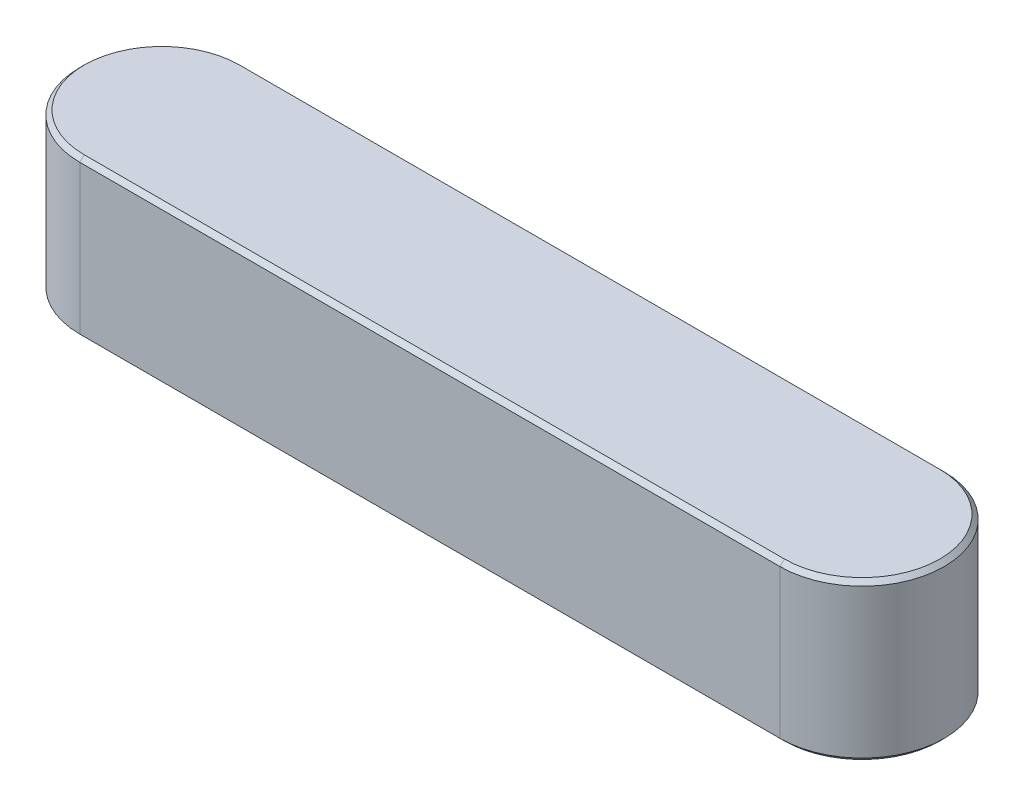
ISO-10303-21;
HEADER;
FILE_DESCRIPTION(('STEP AP214'),'2;1');
FILE_NAME('part.step','',(''),(''),'','','');
FILE_SCHEMA(('AUTOMOTIVE_DESIGN { 1 0 10303 214 1 1 1 1 }'));
ENDSEC;
DATA;
#1=APPLICATION_CONTEXT('core data for automotive mechanical design processes');
#2=APPLICATION_PROTOCOL_DEFINITION('international standard','automotive_design',2000,#1);
#3=PRODUCT_CONTEXT('',#1,'mechanical');
#4=PRODUCT('Part','Part','',(#3));
#5=PRODUCT_RELATED_PRODUCT_CATEGORY('part','',(#4));
#6=PRODUCT_DEFINITION_FORMATION('','',#4);
#7=PRODUCT_DEFINITION_CONTEXT('part definition',#1,'design');
#8=PRODUCT_DEFINITION('design','',#6,#7);
#9=PRODUCT_DEFINITION_SHAPE('','',#8);
#10=(LENGTH_UNIT() NAMED_UNIT(*) SI_UNIT(.MILLI.,.METRE.));
#11=(NAMED_UNIT(*) PLANE_ANGLE_UNIT() SI_UNIT($,.RADIAN.));
#12=(NAMED_UNIT(*) SI_UNIT($,.STERADIAN.) SOLID_ANGLE_UNIT());
#13=UNCERTAINTY_MEASURE_WITH_UNIT(LENGTH_MEASURE(1.E-05),#10,'distance_accuracy_value','');
#14=(GEOMETRIC_REPRESENTATION_CONTEXT(3) GLOBAL_UNCERTAINTY_ASSIGNED_CONTEXT((#13)) GLOBAL_UNIT_ASSIGNED_CONTEXT((#10,
#11,#12)) REPRESENTATION_CONTEXT('',''));
#15=CARTESIAN_POINT('',(0.,0.,0.));
#16=DIRECTION('',(0.,0.,1.));
#17=DIRECTION('',(1.,0.,0.));
#18=AXIS2_PLACEMENT_3D('',#15,#16,#17);
#19=CARTESIAN_POINT('',(0.4,0.09,0.));
#20=DIRECTION('',(0.,-1.,0.));
#21=DIRECTION('',(0.,0.,-1.));
#22=AXIS2_PLACEMENT_3D('',#19,#20,#21);
#23=CYLINDRICAL_SURFACE('',#22,0.09375);
#24=DIRECTION('',(0.,-1.,0.));
#25=VECTOR('',#24,1.);
#26=CARTESIAN_POINT('',(0.4,0.09,0.0937499999999998));
#27=LINE('',#26,#25);
#28=CARTESIAN_POINT('',(0.4,0.0850000000000006,0.0937499999999998));
#29=VERTEX_POINT('',#28);
#30=CARTESIAN_POINT('',(0.4,-0.0849999999999996,0.0937499999999998));
#31=VERTEX_POINT('',#30);
#32=EDGE_CURVE('E165',#29,#31,#27,.T.);
#33=ORIENTED_EDGE('',*,*,#32,.T.);
#34=CARTESIAN_POINT('',(0.4,-0.0849999999999997,0.));
#35=DIRECTION('',(0.,1.,0.));
#36=DIRECTION('',(0.,0.,1.));
#37=AXIS2_PLACEMENT_3D('',#34,#35,#36);
#38=CIRCLE('',#37,0.09375);
#39=CARTESIAN_POINT('',(0.4,-0.0849999999999996,-0.0937500000000002));
#40=VERTEX_POINT('',#39);
#41=EDGE_CURVE('E179',#31,#40,#38,.T.);
#42=ORIENTED_EDGE('',*,*,#41,.T.);
#43=DIRECTION('',(0.,-1.,0.));
#44=VECTOR('',#43,1.);
#45=CARTESIAN_POINT('',(0.4,0.09,-0.0937500000000002));
#46=LINE('',#45,#44);
#47=CARTESIAN_POINT('',(0.4,0.0850000000000006,-0.0937500000000002));
#48=VERTEX_POINT('',#47);
#49=EDGE_CURVE('E136',#48,#40,#46,.T.);
#50=ORIENTED_EDGE('',*,*,#49,.F.);
#51=CARTESIAN_POINT('',(0.4,0.0850000000000006,0.));
#52=DIRECTION('',(0.,1.,0.));
#53=DIRECTION('',(0.,0.,1.));
#54=AXIS2_PLACEMENT_3D('',#51,#52,#53);
#55=CIRCLE('',#54,0.09375);
#56=EDGE_CURVE('E182',#48,#29,#55,.F.);
#57=ORIENTED_EDGE('',*,*,#56,.T.);
#58=EDGE_LOOP('',(#33,#42,#50,#57));
#59=FACE_BOUND('',#58,.T.);
#60=ADVANCED_FACE('F45',(#59),#23,.T.);
#61=CARTESIAN_POINT('',(0.4,0.09,-0.0937500000000002));
#62=DIRECTION('',(0.,0.,1.));
#63=DIRECTION('',(1.,0.,0.));
#64=AXIS2_PLACEMENT_3D('',#61,#62,#63);
#65=PLANE('',#64);
#66=ORIENTED_EDGE('',*,*,#49,.T.);
#67=DIRECTION('',(-1.,0.,0.));
#68=VECTOR('',#67,1.);
#69=CARTESIAN_POINT('',(0.4,-0.0849999999999997,-0.0937500000000002));
#70=LINE('',#69,#68);
#71=CARTESIAN_POINT('',(-0.4,-0.0849999999999996,-0.0937499999999999));
#72=VERTEX_POINT('',#71);
#73=EDGE_CURVE('E134',#40,#72,#70,.T.);
#74=ORIENTED_EDGE('',*,*,#73,.T.);
#75=DIRECTION('',(0.,-1.,0.));
#76=VECTOR('',#75,1.);
#77=CARTESIAN_POINT('',(-0.4,0.09,-0.0937499999999999));
#78=LINE('',#77,#76);
#79=CARTESIAN_POINT('',(-0.4,0.0850000000000006,-0.0937499999999999));
#80=VERTEX_POINT('',#79);
#81=EDGE_CURVE('E116',#80,#72,#78,.T.);
#82=ORIENTED_EDGE('',*,*,#81,.F.);
#83=DIRECTION('',(1.,0.,0.));
#84=VECTOR('',#83,1.);
#85=CARTESIAN_POINT('',(0.4,0.0850000000000006,-0.0937500000000002));
#86=LINE('',#85,#84);
#87=EDGE_CURVE('E131',#80,#48,#86,.T.);
#88=ORIENTED_EDGE('',*,*,#87,.T.);
#89=EDGE_LOOP('',(#66,#74,#82,#88));
#90=FACE_BOUND('',#89,.T.);
#91=ADVANCED_FACE('F130',(#90),#65,.F.);
#92=CARTESIAN_POINT('',(-0.4,0.09,0.));
#93=DIRECTION('',(0.,-1.,0.));
#94=DIRECTION('',(0.,0.,-1.));
#95=AXIS2_PLACEMENT_3D('',#92,#93,#94);
#96=CYLINDRICAL_SURFACE('',#95,0.09375);
#97=ORIENTED_EDGE('',*,*,#81,.T.);
#98=CARTESIAN_POINT('',(-0.4,-0.0849999999999997,0.));
#99=DIRECTION('',(0.,1.,0.));
#100=DIRECTION('',(0.,0.,1.));
#101=AXIS2_PLACEMENT_3D('',#98,#99,#100);
#102=CIRCLE('',#101,0.09375);
#103=CARTESIAN_POINT('',(-0.4,-0.0849999999999996,0.0937500000000001));
#104=VERTEX_POINT('',#103);
#105=EDGE_CURVE('E123',#72,#104,#102,.T.);
#106=ORIENTED_EDGE('',*,*,#105,.T.);
#107=DIRECTION('',(0.,-1.,0.));
#108=VECTOR('',#107,1.);
#109=CARTESIAN_POINT('',(-0.4,0.09,0.0937500000000001));
#110=LINE('',#109,#108);
#111=CARTESIAN_POINT('',(-0.4,0.0850000000000006,0.0937500000000001));
#112=VERTEX_POINT('',#111);
#113=EDGE_CURVE('E118',#112,#104,#110,.T.);
#114=ORIENTED_EDGE('',*,*,#113,.F.);
#115=CARTESIAN_POINT('',(-0.4,0.0850000000000006,0.));
#116=DIRECTION('',(0.,1.,0.));
#117=DIRECTION('',(0.,0.,1.));
#118=AXIS2_PLACEMENT_3D('',#115,#116,#117);
#119=CIRCLE('',#118,0.09375);
#120=EDGE_CURVE('E113',#112,#80,#119,.F.);
#121=ORIENTED_EDGE('',*,*,#120,.T.);
#122=EDGE_LOOP('',(#97,#106,#114,#121));
#123=FACE_BOUND('',#122,.T.);
#124=ADVANCED_FACE('F115',(#123),#96,.T.);
#125=CARTESIAN_POINT('',(0.4,0.09,0.0937499999999998));
#126=DIRECTION('',(0.,0.,-1.));
#127=DIRECTION('',(-1.,0.,0.));
#128=AXIS2_PLACEMENT_3D('',#125,#126,#127);
#129=PLANE('',#128);
#130=ORIENTED_EDGE('',*,*,#113,.T.);
#131=DIRECTION('',(1.,0.,0.));
#132=VECTOR('',#131,1.);
#133=CARTESIAN_POINT('',(0.4,-0.0849999999999997,0.0937499999999998));
#134=LINE('',#133,#132);
#135=EDGE_CURVE('E185',#104,#31,#134,.T.);
#136=ORIENTED_EDGE('',*,*,#135,.T.);
#137=ORIENTED_EDGE('',*,*,#32,.F.);
#138=DIRECTION('',(-1.,0.,0.));
#139=VECTOR('',#138,1.);
#140=CARTESIAN_POINT('',(-0.4,0.0850000000000006,0.0937500000000001));
#141=LINE('',#140,#139);
#142=EDGE_CURVE('E188',#29,#112,#141,.T.);
#143=ORIENTED_EDGE('',*,*,#142,.T.);
#144=EDGE_LOOP('',(#130,#136,#137,#143));
#145=FACE_BOUND('',#144,.T.);
#146=ADVANCED_FACE('F236',(#145),#129,.F.);
#147=CARTESIAN_POINT('',(0.4,0.09,0.));
#148=DIRECTION('',(0.,1.,0.));
#149=DIRECTION('',(0.,0.,1.));
#150=AXIS2_PLACEMENT_3D('',#147,#148,#149);
#151=PLANE('',#150);
#152=CARTESIAN_POINT('',(-0.4,0.09,0.));
#153=DIRECTION('',(0.,1.,0.));
#154=DIRECTION('',(0.,0.,1.));
#155=AXIS2_PLACEMENT_3D('',#152,#153,#154);
#156=CIRCLE('',#155,0.0887500000000005);
#157=CARTESIAN_POINT('',(-0.4,0.09,-0.0887500000000005));
#158=VERTEX_POINT('',#157);
#159=CARTESIAN_POINT('',(-0.4,0.09,0.0887500000000006));
#160=VERTEX_POINT('',#159);
#161=EDGE_CURVE('E56',#158,#160,#156,.T.);
#162=ORIENTED_EDGE('',*,*,#161,.T.);
#163=DIRECTION('',(1.,0.,0.));
#164=VECTOR('',#163,1.);
#165=CARTESIAN_POINT('',(0.4,0.09,0.0887500000000004));
#166=LINE('',#165,#164);
#167=CARTESIAN_POINT('',(0.4,0.09,0.0887500000000004));
#168=VERTEX_POINT('',#167);
#169=EDGE_CURVE('E11',#160,#168,#166,.T.);
#170=ORIENTED_EDGE('',*,*,#169,.T.);
#171=CARTESIAN_POINT('',(0.4,0.09,0.));
#172=DIRECTION('',(0.,1.,0.));
#173=DIRECTION('',(0.,0.,1.));
#174=AXIS2_PLACEMENT_3D('',#171,#172,#173);
#175=CIRCLE('',#174,0.0887500000000005);
#176=CARTESIAN_POINT('',(0.4,0.09,-0.0887500000000007));
#177=VERTEX_POINT('',#176);
#178=EDGE_CURVE('E176',#168,#177,#175,.T.);
#179=ORIENTED_EDGE('',*,*,#178,.T.);
#180=DIRECTION('',(-1.,0.,0.));
#181=VECTOR('',#180,1.);
#182=CARTESIAN_POINT('',(-0.4,0.09,-0.0887500000000005));
#183=LINE('',#182,#181);
#184=EDGE_CURVE('E67',#177,#158,#183,.T.);
#185=ORIENTED_EDGE('',*,*,#184,.T.);
#186=EDGE_LOOP('',(#162,#170,#179,#185));
#187=FACE_BOUND('',#186,.T.);
#188=ADVANCED_FACE('F242',(#187),#151,.T.);
#189=CARTESIAN_POINT('',(0.4,-0.09,0.));
#190=DIRECTION('',(0.,1.,0.));
#191=DIRECTION('',(0.,0.,1.));
#192=AXIS2_PLACEMENT_3D('',#189,#190,#191);
#193=PLANE('',#192);
#194=CARTESIAN_POINT('',(-0.4,-0.09,0.));
#195=DIRECTION('',(0.,1.,0.));
#196=DIRECTION('',(0.,0.,1.));
#197=AXIS2_PLACEMENT_3D('',#194,#195,#196);
#198=CIRCLE('',#197,0.0887499999999997);
#199=CARTESIAN_POINT('',(-0.4,-0.09,0.0887499999999997));
#200=VERTEX_POINT('',#199);
#201=CARTESIAN_POINT('',(-0.4,-0.09,-0.0887499999999996));
#202=VERTEX_POINT('',#201);
#203=EDGE_CURVE('E196',#200,#202,#198,.F.);
#204=ORIENTED_EDGE('',*,*,#203,.T.);
#205=DIRECTION('',(1.,0.,0.));
#206=VECTOR('',#205,1.);
#207=CARTESIAN_POINT('',(0.4,-0.09,-0.0887499999999998));
#208=LINE('',#207,#206);
#209=CARTESIAN_POINT('',(0.4,-0.09,-0.0887499999999998));
#210=VERTEX_POINT('',#209);
#211=EDGE_CURVE('E124',#202,#210,#208,.T.);
#212=ORIENTED_EDGE('',*,*,#211,.T.);
#213=CARTESIAN_POINT('',(0.4,-0.09,0.));
#214=DIRECTION('',(0.,1.,0.));
#215=DIRECTION('',(0.,0.,1.));
#216=AXIS2_PLACEMENT_3D('',#213,#214,#215);
#217=CIRCLE('',#216,0.0887499999999997);
#218=CARTESIAN_POINT('',(0.4,-0.09,0.0887499999999995));
#219=VERTEX_POINT('',#218);
#220=EDGE_CURVE('E202',#210,#219,#217,.F.);
#221=ORIENTED_EDGE('',*,*,#220,.T.);
#222=DIRECTION('',(-1.,0.,0.));
#223=VECTOR('',#222,1.);
#224=CARTESIAN_POINT('',(0.4,-0.09,0.0887499999999995));
#225=LINE('',#224,#223);
#226=EDGE_CURVE('E199',#219,#200,#225,.T.);
#227=ORIENTED_EDGE('',*,*,#226,.T.);
#228=EDGE_LOOP('',(#204,#212,#221,#227));
#229=FACE_BOUND('',#228,.T.);
#230=ADVANCED_FACE('F244',(#229),#193,.F.);
#231=CARTESIAN_POINT('',(0.4,-0.0849999999999997,0.0937499999999998));
#232=DIRECTION('',(0.,0.707106781186549,-0.707106781186546));
#233=DIRECTION('',(1.,0.,0.));
#234=AXIS2_PLACEMENT_3D('',#231,#232,#233);
#235=PLANE('',#234);
#236=DIRECTION('',(0.,0.707106781186546,0.707106781186549));
#237=VECTOR('',#236,1.);
#238=CARTESIAN_POINT('',(-0.4,-0.09,0.0887499999999997));
#239=LINE('',#238,#237);
#240=EDGE_CURVE('E166',#200,#104,#239,.T.);
#241=ORIENTED_EDGE('',*,*,#240,.F.);
#242=ORIENTED_EDGE('',*,*,#226,.F.);
#243=DIRECTION('',(0.,-0.707106781186546,-0.707106781186549));
#244=VECTOR('',#243,1.);
#245=CARTESIAN_POINT('',(0.4,-0.0849999999999997,0.0937499999999998));
#246=LINE('',#245,#244);
#247=EDGE_CURVE('E161',#31,#219,#246,.T.);
#248=ORIENTED_EDGE('',*,*,#247,.F.);
#249=ORIENTED_EDGE('',*,*,#135,.F.);
#250=EDGE_LOOP('',(#241,#242,#248,#249));
#251=FACE_BOUND('',#250,.T.);
#252=ADVANCED_FACE('F223',(#251),#235,.F.);
#253=CARTESIAN_POINT('',(0.4,-0.0849999999999997,0.));
#254=DIRECTION('',(0.,1.,0.));
#255=DIRECTION('',(0.,0.,1.));
#256=AXIS2_PLACEMENT_3D('',#253,#254,#255);
#257=CONICAL_SURFACE('',#256,0.09375,0.785398163397451);
#258=ORIENTED_EDGE('',*,*,#247,.T.);
#259=ORIENTED_EDGE('',*,*,#220,.F.);
#260=DIRECTION('',(0.,-0.707106781186546,0.707106781186549));
#261=VECTOR('',#260,1.);
#262=CARTESIAN_POINT('',(0.4,-0.0849999999999997,-0.0937500000000002));
#263=LINE('',#262,#261);
#264=EDGE_CURVE('E150',#40,#210,#263,.T.);
#265=ORIENTED_EDGE('',*,*,#264,.F.);
#266=ORIENTED_EDGE('',*,*,#41,.F.);
#267=EDGE_LOOP('',(#258,#259,#265,#266));
#268=FACE_BOUND('',#267,.T.);
#269=ADVANCED_FACE('F227',(#268),#257,.T.);
#270=CARTESIAN_POINT('',(-0.4,-0.0849999999999997,0.));
#271=DIRECTION('',(0.,1.,0.));
#272=DIRECTION('',(0.,0.,1.));
#273=AXIS2_PLACEMENT_3D('',#270,#271,#272);
#274=CONICAL_SURFACE('',#273,0.09375,0.785398163397451);
#275=ORIENTED_EDGE('',*,*,#240,.T.);
#276=ORIENTED_EDGE('',*,*,#105,.F.);
#277=DIRECTION('',(0.,0.707106781186546,-0.707106781186549));
#278=VECTOR('',#277,1.);
#279=CARTESIAN_POINT('',(-0.4,-0.09,-0.0887499999999996));
#280=LINE('',#279,#278);
#281=EDGE_CURVE('E147',#202,#72,#280,.T.);
#282=ORIENTED_EDGE('',*,*,#281,.F.);
#283=ORIENTED_EDGE('',*,*,#203,.F.);
#284=EDGE_LOOP('',(#275,#276,#282,#283));
#285=FACE_BOUND('',#284,.T.);
#286=ADVANCED_FACE('F235',(#285),#274,.T.);
#287=CARTESIAN_POINT('',(0.4,-0.0849999999999997,-0.0937500000000002));
#288=DIRECTION('',(0.,0.707106781186549,0.707106781186546));
#289=DIRECTION('',(-1.,0.,0.));
#290=AXIS2_PLACEMENT_3D('',#287,#288,#289);
#291=PLANE('',#290);
#292=ORIENTED_EDGE('',*,*,#264,.T.);
#293=ORIENTED_EDGE('',*,*,#211,.F.);
#294=ORIENTED_EDGE('',*,*,#281,.T.);
#295=ORIENTED_EDGE('',*,*,#73,.F.);
#296=EDGE_LOOP('',(#292,#293,#294,#295));
#297=FACE_BOUND('',#296,.T.);
#298=ADVANCED_FACE('F230',(#297),#291,.F.);
#299=CARTESIAN_POINT('',(0.4,0.09,-0.0887500000000007));
#300=DIRECTION('',(0.,0.707106781186552,-0.707106781186543));
#301=DIRECTION('',(1.,0.,0.));
#302=AXIS2_PLACEMENT_3D('',#299,#300,#301);
#303=PLANE('',#302);
#304=DIRECTION('',(0.,0.707106781186543,0.707106781186552));
#305=VECTOR('',#304,1.);
#306=CARTESIAN_POINT('',(0.4,0.0850000000000006,-0.0937500000000002));
#307=LINE('',#306,#305);
#308=EDGE_CURVE('E141',#48,#177,#307,.T.);
#309=ORIENTED_EDGE('',*,*,#308,.F.);
#310=ORIENTED_EDGE('',*,*,#87,.F.);
#311=DIRECTION('',(0.,-0.707106781186543,-0.707106781186552));
#312=VECTOR('',#311,1.);
#313=CARTESIAN_POINT('',(-0.4,0.09,-0.0887500000000005));
#314=LINE('',#313,#312);
#315=EDGE_CURVE('E50',#158,#80,#314,.T.);
#316=ORIENTED_EDGE('',*,*,#315,.F.);
#317=ORIENTED_EDGE('',*,*,#184,.F.);
#318=EDGE_LOOP('',(#309,#310,#316,#317));
#319=FACE_BOUND('',#318,.T.);
#320=ADVANCED_FACE('F48',(#319),#303,.T.);
#321=CARTESIAN_POINT('',(-0.4,0.09,0.));
#322=DIRECTION('',(0.,-1.,0.));
#323=DIRECTION('',(0.,0.,-1.));
#324=AXIS2_PLACEMENT_3D('',#321,#322,#323);
#325=CONICAL_SURFACE('',#324,0.0887500000000005,0.785398163397455);
#326=ORIENTED_EDGE('',*,*,#315,.T.);
#327=ORIENTED_EDGE('',*,*,#120,.F.);
#328=DIRECTION('',(0.,-0.707106781186543,0.707106781186552));
#329=VECTOR('',#328,1.);
#330=CARTESIAN_POINT('',(-0.4,0.09,0.0887500000000006));
#331=LINE('',#330,#329);
#332=EDGE_CURVE('E152',#160,#112,#331,.T.);
#333=ORIENTED_EDGE('',*,*,#332,.F.);
#334=ORIENTED_EDGE('',*,*,#161,.F.);
#335=EDGE_LOOP('',(#326,#327,#333,#334));
#336=FACE_BOUND('',#335,.T.);
#337=ADVANCED_FACE('F145',(#336),#325,.T.);
#338=CARTESIAN_POINT('',(0.4,0.09,0.));
#339=DIRECTION('',(0.,-1.,0.));
#340=DIRECTION('',(0.,0.,-1.));
#341=AXIS2_PLACEMENT_3D('',#338,#339,#340);
#342=CONICAL_SURFACE('',#341,0.0887500000000005,0.785398163397455);
#343=ORIENTED_EDGE('',*,*,#308,.T.);
#344=ORIENTED_EDGE('',*,*,#178,.F.);
#345=DIRECTION('',(0.,0.707106781186543,-0.707106781186552));
#346=VECTOR('',#345,1.);
#347=CARTESIAN_POINT('',(0.4,0.0850000000000006,0.0937499999999998));
#348=LINE('',#347,#346);
#349=EDGE_CURVE('E156',#29,#168,#348,.T.);
#350=ORIENTED_EDGE('',*,*,#349,.F.);
#351=ORIENTED_EDGE('',*,*,#56,.F.);
#352=EDGE_LOOP('',(#343,#344,#350,#351));
#353=FACE_BOUND('',#352,.T.);
#354=ADVANCED_FACE('F241',(#353),#342,.T.);
#355=CARTESIAN_POINT('',(0.4,0.09,0.0887500000000004));
#356=DIRECTION('',(0.,0.707106781186552,0.707106781186543));
#357=DIRECTION('',(-1.,0.,0.));
#358=AXIS2_PLACEMENT_3D('',#355,#356,#357);
#359=PLANE('',#358);
#360=ORIENTED_EDGE('',*,*,#332,.T.);
#361=ORIENTED_EDGE('',*,*,#142,.F.);
#362=ORIENTED_EDGE('',*,*,#349,.T.);
#363=ORIENTED_EDGE('',*,*,#169,.F.);
#364=EDGE_LOOP('',(#360,#361,#362,#363));
#365=FACE_BOUND('',#364,.T.);
#366=ADVANCED_FACE('F239',(#365),#359,.T.);
#367=CLOSED_SHELL('',(#60,#91,#124,#146,#188,#230,#252,#269,#286,#298,#320,#337,#354,#366));
#368=MANIFOLD_SOLID_BREP('B2',#367);
#369=ADVANCED_BREP_SHAPE_REPRESENTATION('',(#18,#368),#14);
#370=SHAPE_DEFINITION_REPRESENTATION(#9,#369);
ENDSEC;
END-ISO-10303-21;
